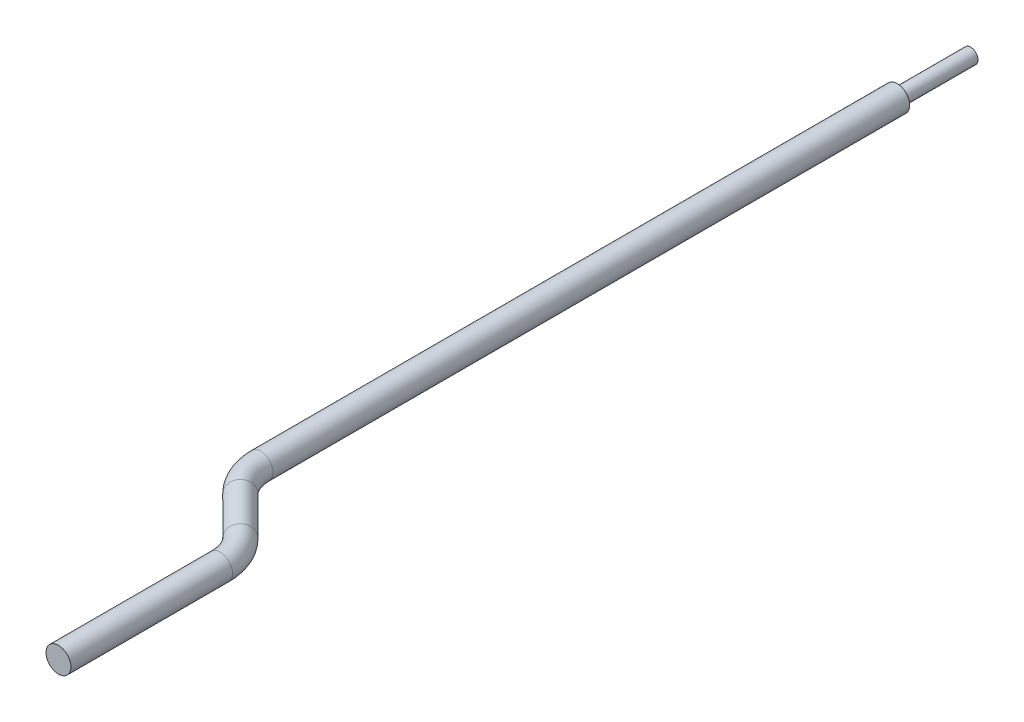
ISO-10303-21;
HEADER;
FILE_DESCRIPTION(('STEP AP214'),'2;1');
FILE_NAME('part.step','',(''),(''),'','','');
FILE_SCHEMA(('AUTOMOTIVE_DESIGN { 1 0 10303 214 1 1 1 1 }'));
ENDSEC;
DATA;
#1=APPLICATION_CONTEXT('core data for automotive mechanical design processes');
#2=APPLICATION_PROTOCOL_DEFINITION('international standard','automotive_design',2000,#1);
#3=PRODUCT_CONTEXT('',#1,'mechanical');
#4=PRODUCT('Part','Part','',(#3));
#5=PRODUCT_RELATED_PRODUCT_CATEGORY('part','',(#4));
#6=PRODUCT_DEFINITION_FORMATION('','',#4);
#7=PRODUCT_DEFINITION_CONTEXT('part definition',#1,'design');
#8=PRODUCT_DEFINITION('design','',#6,#7);
#9=PRODUCT_DEFINITION_SHAPE('','',#8);
#10=(LENGTH_UNIT() NAMED_UNIT(*) SI_UNIT(.MILLI.,.METRE.));
#11=(NAMED_UNIT(*) PLANE_ANGLE_UNIT() SI_UNIT($,.RADIAN.));
#12=(NAMED_UNIT(*) SI_UNIT($,.STERADIAN.) SOLID_ANGLE_UNIT());
#13=UNCERTAINTY_MEASURE_WITH_UNIT(LENGTH_MEASURE(1.E-05),#10,'distance_accuracy_value','');
#14=(GEOMETRIC_REPRESENTATION_CONTEXT(3) GLOBAL_UNCERTAINTY_ASSIGNED_CONTEXT((#13)) GLOBAL_UNIT_ASSIGNED_CONTEXT((#10,
#11,#12)) REPRESENTATION_CONTEXT('',''));
#15=CARTESIAN_POINT('',(0.,0.,0.));
#16=DIRECTION('',(0.,0.,1.));
#17=DIRECTION('',(1.,0.,0.));
#18=AXIS2_PLACEMENT_3D('',#15,#16,#17);
#19=CARTESIAN_POINT('',(0.,0.,35.5599999999999));
#20=DIRECTION('',(0.,0.,-0.999999999999999));
#21=DIRECTION('',(-1.,0.,0.));
#22=AXIS2_PLACEMENT_3D('',#19,#20,#21);
#23=CYLINDRICAL_SURFACE('',#22,0.6477);
#24=CARTESIAN_POINT('',(0.,0.,36.8299999999999));
#25=DIRECTION('',(0.,0.,0.999999999999999));
#26=DIRECTION('',(1.,0.,0.));
#27=AXIS2_PLACEMENT_3D('',#24,#25,#26);
#28=CIRCLE('',#27,0.6477);
#29=CARTESIAN_POINT('',(-0.647700000000018,0.,36.8299999999999));
#30=VERTEX_POINT('',#29);
#31=EDGE_CURVE('E49',#30,#30,#28,.T.);
#32=ORIENTED_EDGE('',*,*,#31,.F.);
#33=EDGE_LOOP('',(#32));
#34=FACE_BOUND('',#33,.T.);
#35=CARTESIAN_POINT('',(0.,0.,3.81));
#36=DIRECTION('',(0.,0.,-0.999999999999999));
#37=DIRECTION('',(-1.,0.,0.));
#38=AXIS2_PLACEMENT_3D('',#35,#36,#37);
#39=CIRCLE('',#38,0.6477);
#40=CARTESIAN_POINT('',(-0.6477,0.,3.81));
#41=VERTEX_POINT('',#40);
#42=EDGE_CURVE('E52',#41,#41,#39,.T.);
#43=ORIENTED_EDGE('',*,*,#42,.F.);
#44=EDGE_LOOP('',(#43));
#45=FACE_BOUND('',#44,.T.);
#46=ADVANCED_FACE('F30',(#34,#45),#23,.T.);
#47=CARTESIAN_POINT('',(3.47980000000001,0.,42.4140048968553));
#48=DIRECTION('',(0.,0.,0.999999999999999));
#49=DIRECTION('',(1.,0.,0.));
#50=AXIS2_PLACEMENT_3D('',#47,#48,#49);
#51=CYLINDRICAL_SURFACE('',#50,0.6477);
#52=CARTESIAN_POINT('',(3.47980000000001,0.,42.4140048968553));
#53=DIRECTION('',(0.,0.,0.999999999999999));
#54=DIRECTION('',(1.,0.,0.));
#55=AXIS2_PLACEMENT_3D('',#52,#53,#54);
#56=CIRCLE('',#55,0.6477);
#57=CARTESIAN_POINT('',(4.1275,0.,42.4140048968553));
#58=VERTEX_POINT('',#57);
#59=EDGE_CURVE('E36',#58,#58,#56,.T.);
#60=ORIENTED_EDGE('',*,*,#59,.T.);
#61=EDGE_LOOP('',(#60));
#62=FACE_BOUND('',#61,.T.);
#63=CARTESIAN_POINT('',(3.47980000000002,0.,50.7999999999999));
#64=DIRECTION('',(0.,0.,0.999999999999999));
#65=DIRECTION('',(1.,0.,0.));
#66=AXIS2_PLACEMENT_3D('',#63,#64,#65);
#67=CIRCLE('',#66,0.6477);
#68=CARTESIAN_POINT('',(4.12750000000002,0.,50.7999999999999));
#69=VERTEX_POINT('',#68);
#70=EDGE_CURVE('E10',#69,#69,#67,.T.);
#71=ORIENTED_EDGE('',*,*,#70,.F.);
#72=EDGE_LOOP('',(#71));
#73=FACE_BOUND('',#72,.T.);
#74=ADVANCED_FACE('F73',(#62,#73),#51,.T.);
#75=CARTESIAN_POINT('',(0.939800000000001,0.,42.4140048968553));
#76=DIRECTION('',(0.,-1.,0.));
#77=DIRECTION('',(0.,0.,-0.999999999999999));
#78=AXIS2_PLACEMENT_3D('',#75,#76,#77);
#79=TOROIDAL_SURFACE('',#78,2.54,0.6477);
#80=CARTESIAN_POINT('',(2.73585122421383,0.,40.6179536726414));
#81=DIRECTION('',(0.707106781186549,0.,0.707106781186545));
#82=DIRECTION('',(0.707106781186545,0.,-0.707106781186548));
#83=AXIS2_PLACEMENT_3D('',#80,#81,#82);
#84=CIRCLE('',#83,0.6477);
#85=CARTESIAN_POINT('',(3.19384428638836,0.,40.1599606104669));
#86=VERTEX_POINT('',#85);
#87=EDGE_CURVE('E40',#86,#86,#84,.T.);
#88=CARTESIAN_POINT('',(0.939800000000001,0.,42.4140048968553));
#89=DIRECTION('',(0.,-1.,0.));
#90=DIRECTION('',(0.,0.,-0.999999999999999));
#91=AXIS2_PLACEMENT_3D('',#88,#89,#90);
#92=CIRCLE('',#91,3.1877);
#93=EDGE_CURVE('',#86,#58,#92,.T.);
#94=ORIENTED_EDGE('',*,*,#87,.T.);
#95=ORIENTED_EDGE('',*,*,#59,.F.);
#96=ORIENTED_EDGE('',*,*,#93,.T.);
#97=ORIENTED_EDGE('',*,*,#93,.F.);
#98=EDGE_LOOP('',(#94,#96,#95,#97));
#99=FACE_BOUND('',#98,.T.);
#100=ADVANCED_FACE('F78',(#99),#79,.T.);
#101=CARTESIAN_POINT('',(0.743948775786162,0.,38.6260512242138));
#102=DIRECTION('',(0.70710678118655,0.,0.707106781186544));
#103=DIRECTION('',(0.707106781186544,0.,-0.707106781186549));
#104=AXIS2_PLACEMENT_3D('',#101,#102,#103);
#105=CYLINDRICAL_SURFACE('',#104,0.6477);
#106=CARTESIAN_POINT('',(0.743948775786162,0.,38.6260512242138));
#107=DIRECTION('',(0.707106781186549,0.,0.707106781186545));
#108=DIRECTION('',(0.707106781186545,0.,-0.707106781186548));
#109=AXIS2_PLACEMENT_3D('',#106,#107,#108);
#110=CIRCLE('',#109,0.6477);
#111=CARTESIAN_POINT('',(0.285955713611637,0.,39.0840442863883));
#112=VERTEX_POINT('',#111);
#113=EDGE_CURVE('E44',#112,#112,#110,.T.);
#114=ORIENTED_EDGE('',*,*,#113,.T.);
#115=EDGE_LOOP('',(#114));
#116=FACE_BOUND('',#115,.T.);
#117=ORIENTED_EDGE('',*,*,#87,.F.);
#118=EDGE_LOOP('',(#117));
#119=FACE_BOUND('',#118,.T.);
#120=ADVANCED_FACE('F85',(#116,#119),#105,.T.);
#121=CARTESIAN_POINT('',(2.53999999999999,0.,36.8299999999999));
#122=DIRECTION('',(0.,1.,0.));
#123=DIRECTION('',(0.,0.,0.999999999999999));
#124=AXIS2_PLACEMENT_3D('',#121,#122,#123);
#125=TOROIDAL_SURFACE('',#124,2.54,0.6477);
#126=CARTESIAN_POINT('',(2.53999999999999,0.,36.8299999999999));
#127=DIRECTION('',(0.,1.,0.));
#128=DIRECTION('',(0.,0.,0.999999999999999));
#129=AXIS2_PLACEMENT_3D('',#126,#127,#128);
#130=CIRCLE('',#129,3.18770000000001);
#131=EDGE_CURVE('',#30,#112,#130,.T.);
#132=ORIENTED_EDGE('',*,*,#31,.T.);
#133=ORIENTED_EDGE('',*,*,#113,.F.);
#134=ORIENTED_EDGE('',*,*,#131,.T.);
#135=ORIENTED_EDGE('',*,*,#131,.F.);
#136=EDGE_LOOP('',(#132,#134,#133,#135));
#137=FACE_BOUND('',#136,.T.);
#138=ADVANCED_FACE('F82',(#137),#125,.T.);
#139=CARTESIAN_POINT('',(3.47980000000002,0.,50.7999999999999));
#140=DIRECTION('',(0.,0.,0.999999999999999));
#141=DIRECTION('',(1.,0.,0.));
#142=AXIS2_PLACEMENT_3D('',#139,#140,#141);
#143=PLANE('',#142);
#144=ORIENTED_EDGE('',*,*,#70,.T.);
#145=EDGE_LOOP('',(#144));
#146=FACE_BOUND('',#145,.T.);
#147=ADVANCED_FACE('F68',(#146),#143,.T.);
#148=CARTESIAN_POINT('',(0.,0.,3.81));
#149=DIRECTION('',(0.,0.,-0.999999999999999));
#150=DIRECTION('',(-1.,0.,0.));
#151=AXIS2_PLACEMENT_3D('',#148,#149,#150);
#152=PLANE('',#151);
#153=CARTESIAN_POINT('',(0.,0.,3.81));
#154=DIRECTION('',(0.,0.,-0.999999999999999));
#155=DIRECTION('',(-1.,0.,0.));
#156=AXIS2_PLACEMENT_3D('',#153,#154,#155);
#157=CIRCLE('',#156,0.381);
#158=CARTESIAN_POINT('',(-0.381,0.,3.81));
#159=VERTEX_POINT('',#158);
#160=EDGE_CURVE('E55',#159,#159,#157,.T.);
#161=ORIENTED_EDGE('',*,*,#160,.F.);
#162=EDGE_LOOP('',(#161));
#163=FACE_BOUND('',#162,.T.);
#164=ORIENTED_EDGE('',*,*,#42,.T.);
#165=EDGE_LOOP('',(#164));
#166=FACE_BOUND('',#165,.T.);
#167=ADVANCED_FACE('F65',(#163,#166),#152,.T.);
#168=CARTESIAN_POINT('',(0.,0.,3.81));
#169=DIRECTION('',(0.,0.,-0.999999999999999));
#170=DIRECTION('',(-1.,0.,0.));
#171=AXIS2_PLACEMENT_3D('',#168,#169,#170);
#172=CYLINDRICAL_SURFACE('',#171,0.381);
#173=ORIENTED_EDGE('',*,*,#160,.T.);
#174=EDGE_LOOP('',(#173));
#175=FACE_BOUND('',#174,.T.);
#176=CARTESIAN_POINT('',(0.,0.,0.));
#177=DIRECTION('',(0.,0.,-0.999999999999999));
#178=DIRECTION('',(-1.,0.,0.));
#179=AXIS2_PLACEMENT_3D('',#176,#177,#178);
#180=CIRCLE('',#179,0.381);
#181=CARTESIAN_POINT('',(-0.381,0.,0.));
#182=VERTEX_POINT('',#181);
#183=EDGE_CURVE('E56',#182,#182,#180,.T.);
#184=ORIENTED_EDGE('',*,*,#183,.F.);
#185=EDGE_LOOP('',(#184));
#186=FACE_BOUND('',#185,.T.);
#187=ADVANCED_FACE('F62',(#175,#186),#172,.T.);
#188=CARTESIAN_POINT('',(0.,0.,0.));
#189=DIRECTION('',(0.,0.,0.999999999999999));
#190=DIRECTION('',(1.,0.,0.));
#191=AXIS2_PLACEMENT_3D('',#188,#189,#190);
#192=PLANE('',#191);
#193=ORIENTED_EDGE('',*,*,#183,.T.);
#194=EDGE_LOOP('',(#193));
#195=FACE_BOUND('',#194,.T.);
#196=ADVANCED_FACE('F99',(#195),#192,.F.);
#197=CLOSED_SHELL('',(#46,#74,#100,#120,#138,#147,#167,#187,#196));
#198=MANIFOLD_SOLID_BREP('B2',#197);
#199=ADVANCED_BREP_SHAPE_REPRESENTATION('',(#18,#198),#14);
#200=SHAPE_DEFINITION_REPRESENTATION(#9,#199);
ENDSEC;
END-ISO-10303-21;
